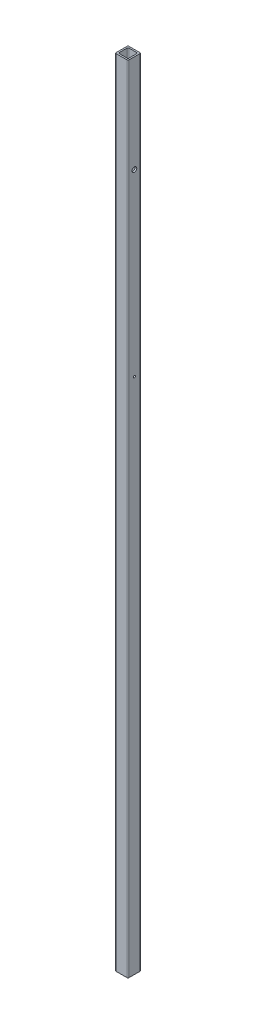
ISO-10303-21;
HEADER;
FILE_DESCRIPTION(('STEP AP214'),'2;1');
FILE_NAME('part.step','',(''),(''),'','','');
FILE_SCHEMA(('AUTOMOTIVE_DESIGN { 1 0 10303 214 1 1 1 1 }'));
ENDSEC;
DATA;
#1=APPLICATION_CONTEXT('core data for automotive mechanical design processes');
#2=APPLICATION_PROTOCOL_DEFINITION('international standard','automotive_design',2000,#1);
#3=PRODUCT_CONTEXT('',#1,'mechanical');
#4=PRODUCT('Part','Part','',(#3));
#5=PRODUCT_RELATED_PRODUCT_CATEGORY('part','',(#4));
#6=PRODUCT_DEFINITION_FORMATION('','',#4);
#7=PRODUCT_DEFINITION_CONTEXT('part definition',#1,'design');
#8=PRODUCT_DEFINITION('design','',#6,#7);
#9=PRODUCT_DEFINITION_SHAPE('','',#8);
#10=(LENGTH_UNIT() NAMED_UNIT(*) SI_UNIT(.MILLI.,.METRE.));
#11=(NAMED_UNIT(*) PLANE_ANGLE_UNIT() SI_UNIT($,.RADIAN.));
#12=(NAMED_UNIT(*) SI_UNIT($,.STERADIAN.) SOLID_ANGLE_UNIT());
#13=UNCERTAINTY_MEASURE_WITH_UNIT(LENGTH_MEASURE(1.E-05),#10,'distance_accuracy_value','');
#14=(GEOMETRIC_REPRESENTATION_CONTEXT(3) GLOBAL_UNCERTAINTY_ASSIGNED_CONTEXT((#13)) GLOBAL_UNIT_ASSIGNED_CONTEXT((#10,
#11,#12)) REPRESENTATION_CONTEXT('',''));
#15=CARTESIAN_POINT('',(0.,0.,0.));
#16=DIRECTION('',(0.,0.,1.));
#17=DIRECTION('',(1.,0.,0.));
#18=AXIS2_PLACEMENT_3D('',#15,#16,#17);
#19=CARTESIAN_POINT('',(12.7,1389.634,0.));
#20=DIRECTION('',(1.,0.,0.));
#21=DIRECTION('',(0.,0.,-1.));
#22=AXIS2_PLACEMENT_3D('',#19,#20,#21);
#23=CYLINDRICAL_SURFACE('',#22,4.7625);
#24=CARTESIAN_POINT('',(9.652,1389.634,0.));
#25=DIRECTION('',(1.,0.,0.));
#26=DIRECTION('',(0.,0.,-1.));
#27=AXIS2_PLACEMENT_3D('',#24,#25,#26);
#28=CIRCLE('',#27,4.7625);
#29=CARTESIAN_POINT('',(9.652,1389.634,-4.7625));
#30=VERTEX_POINT('',#29);
#31=EDGE_CURVE('P0_E152',#30,#30,#28,.T.);
#32=ORIENTED_EDGE('',*,*,#31,.F.);
#33=EDGE_LOOP('',(#32));
#34=FACE_BOUND('',#33,.T.);
#35=CARTESIAN_POINT('',(12.7,1389.634,0.));
#36=DIRECTION('',(1.,0.,0.));
#37=DIRECTION('',(0.,0.,-1.));
#38=AXIS2_PLACEMENT_3D('',#35,#36,#37);
#39=CIRCLE('',#38,4.7625);
#40=CARTESIAN_POINT('',(12.7,1389.634,-4.7625));
#41=VERTEX_POINT('',#40);
#42=EDGE_CURVE('P0_E160',#41,#41,#39,.F.);
#43=ORIENTED_EDGE('',*,*,#42,.F.);
#44=EDGE_LOOP('',(#43));
#45=FACE_BOUND('',#44,.T.);
#46=ADVANCED_FACE('P0_F17',(#34,#45),#23,.F.);
#47=CARTESIAN_POINT('',(-17.9109837404018,1031.875,0.));
#48=DIRECTION('',(1.,0.,0.));
#49=DIRECTION('',(0.,0.,-1.));
#50=AXIS2_PLACEMENT_3D('',#47,#48,#49);
#51=CYLINDRICAL_SURFACE('',#50,2.0193);
#52=CARTESIAN_POINT('',(9.652,1031.875,0.));
#53=DIRECTION('',(1.,0.,0.));
#54=DIRECTION('',(0.,0.,-1.));
#55=AXIS2_PLACEMENT_3D('',#52,#53,#54);
#56=CIRCLE('',#55,2.0193);
#57=CARTESIAN_POINT('',(9.652,1031.875,-2.0193));
#58=VERTEX_POINT('',#57);
#59=EDGE_CURVE('P0_E148',#58,#58,#56,.T.);
#60=ORIENTED_EDGE('',*,*,#59,.F.);
#61=EDGE_LOOP('',(#60));
#62=FACE_BOUND('',#61,.T.);
#63=CARTESIAN_POINT('',(12.7,1031.875,0.));
#64=DIRECTION('',(1.,0.,0.));
#65=DIRECTION('',(0.,0.,-1.));
#66=AXIS2_PLACEMENT_3D('',#63,#64,#65);
#67=CIRCLE('',#66,2.0193);
#68=CARTESIAN_POINT('',(12.7,1031.875,-2.0193));
#69=VERTEX_POINT('',#68);
#70=EDGE_CURVE('P0_E156',#69,#69,#67,.F.);
#71=ORIENTED_EDGE('',*,*,#70,.F.);
#72=EDGE_LOOP('',(#71));
#73=FACE_BOUND('',#72,.T.);
#74=ADVANCED_FACE('P0_F176',(#62,#73),#51,.F.);
#75=CARTESIAN_POINT('',(12.7,1389.634,0.));
#76=DIRECTION('',(1.,0.,0.));
#77=DIRECTION('',(0.,0.,-1.));
#78=AXIS2_PLACEMENT_3D('',#75,#76,#77);
#79=CYLINDRICAL_SURFACE('',#78,4.7625);
#80=CARTESIAN_POINT('',(-9.652,1389.634,0.));
#81=DIRECTION('',(1.,0.,0.));
#82=DIRECTION('',(0.,0.,-1.));
#83=AXIS2_PLACEMENT_3D('',#80,#81,#82);
#84=CIRCLE('',#83,4.7625);
#85=CARTESIAN_POINT('',(-9.652,1389.634,-4.7625));
#86=VERTEX_POINT('',#85);
#87=EDGE_CURVE('P0_E144',#86,#86,#84,.F.);
#88=ORIENTED_EDGE('',*,*,#87,.F.);
#89=EDGE_LOOP('',(#88));
#90=FACE_BOUND('',#89,.T.);
#91=CARTESIAN_POINT('',(-12.7,1389.634,0.));
#92=DIRECTION('',(1.,0.,0.));
#93=DIRECTION('',(0.,0.,-1.));
#94=AXIS2_PLACEMENT_3D('',#91,#92,#93);
#95=CIRCLE('',#94,4.7625);
#96=CARTESIAN_POINT('',(-12.7,1389.634,-4.7625));
#97=VERTEX_POINT('',#96);
#98=EDGE_CURVE('P0_E20',#97,#97,#95,.T.);
#99=ORIENTED_EDGE('',*,*,#98,.F.);
#100=EDGE_LOOP('',(#99));
#101=FACE_BOUND('',#100,.T.);
#102=ADVANCED_FACE('P0_F173',(#90,#101),#79,.F.);
#103=CARTESIAN_POINT('',(-17.9109837404018,1031.875,0.));
#104=DIRECTION('',(1.,0.,0.));
#105=DIRECTION('',(0.,0.,-1.));
#106=AXIS2_PLACEMENT_3D('',#103,#104,#105);
#107=CYLINDRICAL_SURFACE('',#106,2.0193);
#108=CARTESIAN_POINT('',(-12.7,1031.875,0.));
#109=DIRECTION('',(1.,0.,0.));
#110=DIRECTION('',(0.,0.,-1.));
#111=AXIS2_PLACEMENT_3D('',#108,#109,#110);
#112=CIRCLE('',#111,2.0193);
#113=CARTESIAN_POINT('',(-12.7,1031.875,-2.0193));
#114=VERTEX_POINT('',#113);
#115=EDGE_CURVE('P0_E163',#114,#114,#112,.T.);
#116=ORIENTED_EDGE('',*,*,#115,.F.);
#117=EDGE_LOOP('',(#116));
#118=FACE_BOUND('',#117,.T.);
#119=CARTESIAN_POINT('',(-9.652,1031.875,0.));
#120=DIRECTION('',(1.,0.,0.));
#121=DIRECTION('',(0.,0.,-1.));
#122=AXIS2_PLACEMENT_3D('',#119,#120,#121);
#123=CIRCLE('',#122,2.0193);
#124=CARTESIAN_POINT('',(-9.652,1031.875,-2.0193));
#125=VERTEX_POINT('',#124);
#126=EDGE_CURVE('P0_E140',#125,#125,#123,.F.);
#127=ORIENTED_EDGE('',*,*,#126,.F.);
#128=EDGE_LOOP('',(#127));
#129=FACE_BOUND('',#128,.T.);
#130=ADVANCED_FACE('P0_F175',(#118,#129),#107,.F.);
#131=CARTESIAN_POINT('',(-12.7,0.,-11.176));
#132=DIRECTION('',(-1.,0.,0.));
#133=DIRECTION('',(0.,0.,1.));
#134=AXIS2_PLACEMENT_3D('',#131,#132,#133);
#135=PLANE('',#134);
#136=ORIENTED_EDGE('',*,*,#115,.T.);
#137=EDGE_LOOP('',(#136));
#138=FACE_BOUND('',#137,.T.);
#139=ORIENTED_EDGE('',*,*,#98,.T.);
#140=EDGE_LOOP('',(#139));
#141=FACE_BOUND('',#140,.T.);
#142=DIRECTION('',(0.,1.,0.));
#143=VECTOR('',#142,1.);
#144=CARTESIAN_POINT('',(-12.7,0.,-11.176));
#145=LINE('',#144,#143);
#146=CARTESIAN_POINT('',(-12.7,0.,-11.176));
#147=VERTEX_POINT('',#146);
#148=CARTESIAN_POINT('',(-12.7,1584.325,-11.176));
#149=VERTEX_POINT('',#148);
#150=EDGE_CURVE('P0_E135',#147,#149,#145,.T.);
#151=ORIENTED_EDGE('',*,*,#150,.F.);
#152=DIRECTION('',(0.,0.,1.));
#153=VECTOR('',#152,1.);
#154=CARTESIAN_POINT('',(-12.7,0.,0.));
#155=LINE('',#154,#153);
#156=CARTESIAN_POINT('',(-12.7,0.,11.176));
#157=VERTEX_POINT('',#156);
#158=EDGE_CURVE('P0_E417',#147,#157,#155,.T.);
#159=ORIENTED_EDGE('',*,*,#158,.T.);
#160=DIRECTION('',(0.,1.,0.));
#161=VECTOR('',#160,1.);
#162=CARTESIAN_POINT('',(-12.7,0.,11.176));
#163=LINE('',#162,#161);
#164=CARTESIAN_POINT('',(-12.7,1584.325,11.176));
#165=VERTEX_POINT('',#164);
#166=EDGE_CURVE('P0_E104',#165,#157,#163,.F.);
#167=ORIENTED_EDGE('',*,*,#166,.F.);
#168=DIRECTION('',(0.,0.,1.));
#169=VECTOR('',#168,1.);
#170=CARTESIAN_POINT('',(-12.7,1584.325,0.));
#171=LINE('',#170,#169);
#172=EDGE_CURVE('P0_E133',#149,#165,#171,.T.);
#173=ORIENTED_EDGE('',*,*,#172,.F.);
#174=EDGE_LOOP('',(#151,#159,#167,#173));
#175=FACE_BOUND('',#174,.T.);
#176=ADVANCED_FACE('P0_F171',(#138,#141,#175),#135,.T.);
#177=CARTESIAN_POINT('',(-11.176,0.,11.176));
#178=DIRECTION('',(0.,1.,0.));
#179=DIRECTION('',(0.,0.,1.));
#180=AXIS2_PLACEMENT_3D('',#177,#178,#179);
#181=CYLINDRICAL_SURFACE('',#180,1.524);
#182=ORIENTED_EDGE('',*,*,#166,.T.);
#183=CARTESIAN_POINT('',(-11.176,0.,11.176));
#184=DIRECTION('',(0.,1.,0.));
#185=DIRECTION('',(0.,0.,1.));
#186=AXIS2_PLACEMENT_3D('',#183,#184,#185);
#187=CIRCLE('',#186,1.524);
#188=CARTESIAN_POINT('',(-11.176,0.,12.7));
#189=VERTEX_POINT('',#188);
#190=EDGE_CURVE('P0_E116',#157,#189,#187,.T.);
#191=ORIENTED_EDGE('',*,*,#190,.T.);
#192=DIRECTION('',(0.,1.,0.));
#193=VECTOR('',#192,1.);
#194=CARTESIAN_POINT('',(-11.176,0.,12.7));
#195=LINE('',#194,#193);
#196=CARTESIAN_POINT('',(-11.176,1584.325,12.7));
#197=VERTEX_POINT('',#196);
#198=EDGE_CURVE('P0_E109',#197,#189,#195,.F.);
#199=ORIENTED_EDGE('',*,*,#198,.F.);
#200=CARTESIAN_POINT('',(-11.176,1584.325,11.176));
#201=DIRECTION('',(0.,1.,0.));
#202=DIRECTION('',(0.,0.,1.));
#203=AXIS2_PLACEMENT_3D('',#200,#201,#202);
#204=CIRCLE('',#203,1.524);
#205=EDGE_CURVE('P0_E113',#165,#197,#204,.T.);
#206=ORIENTED_EDGE('',*,*,#205,.F.);
#207=EDGE_LOOP('',(#182,#191,#199,#206));
#208=FACE_BOUND('',#207,.T.);
#209=ADVANCED_FACE('P0_F111',(#208),#181,.T.);
#210=CARTESIAN_POINT('',(-11.176,0.,12.7));
#211=DIRECTION('',(0.,0.,1.));
#212=DIRECTION('',(1.,0.,0.));
#213=AXIS2_PLACEMENT_3D('',#210,#211,#212);
#214=PLANE('',#213);
#215=ORIENTED_EDGE('',*,*,#198,.T.);
#216=DIRECTION('',(1.,0.,0.));
#217=VECTOR('',#216,1.);
#218=CARTESIAN_POINT('',(0.,0.,12.7));
#219=LINE('',#218,#217);
#220=CARTESIAN_POINT('',(11.176,0.,12.7));
#221=VERTEX_POINT('',#220);
#222=EDGE_CURVE('P0_E411',#189,#221,#219,.T.);
#223=ORIENTED_EDGE('',*,*,#222,.T.);
#224=DIRECTION('',(0.,1.,0.));
#225=VECTOR('',#224,1.);
#226=CARTESIAN_POINT('',(11.176,0.,12.7));
#227=LINE('',#226,#225);
#228=CARTESIAN_POINT('',(11.176,1584.325,12.7));
#229=VERTEX_POINT('',#228);
#230=EDGE_CURVE('P0_E119',#229,#221,#227,.F.);
#231=ORIENTED_EDGE('',*,*,#230,.F.);
#232=DIRECTION('',(1.,0.,0.));
#233=VECTOR('',#232,1.);
#234=CARTESIAN_POINT('',(0.,1584.325,12.7));
#235=LINE('',#234,#233);
#236=EDGE_CURVE('P0_E122',#197,#229,#235,.T.);
#237=ORIENTED_EDGE('',*,*,#236,.F.);
#238=EDGE_LOOP('',(#215,#223,#231,#237));
#239=FACE_BOUND('',#238,.T.);
#240=ADVANCED_FACE('P0_F123',(#239),#214,.T.);
#241=CARTESIAN_POINT('',(11.176,0.,11.176));
#242=DIRECTION('',(0.,1.,0.));
#243=DIRECTION('',(0.,0.,1.));
#244=AXIS2_PLACEMENT_3D('',#241,#242,#243);
#245=CYLINDRICAL_SURFACE('',#244,1.524);
#246=ORIENTED_EDGE('',*,*,#230,.T.);
#247=CARTESIAN_POINT('',(11.176,0.,11.176));
#248=DIRECTION('',(0.,1.,0.));
#249=DIRECTION('',(0.,0.,1.));
#250=AXIS2_PLACEMENT_3D('',#247,#248,#249);
#251=CIRCLE('',#250,1.524);
#252=CARTESIAN_POINT('',(12.7,0.,11.176));
#253=VERTEX_POINT('',#252);
#254=EDGE_CURVE('P0_E407',#221,#253,#251,.T.);
#255=ORIENTED_EDGE('',*,*,#254,.T.);
#256=DIRECTION('',(0.,1.,0.));
#257=VECTOR('',#256,1.);
#258=CARTESIAN_POINT('',(12.7,0.,11.176));
#259=LINE('',#258,#257);
#260=CARTESIAN_POINT('',(12.7,1584.325,11.176));
#261=VERTEX_POINT('',#260);
#262=EDGE_CURVE('P0_E162',#261,#253,#259,.F.);
#263=ORIENTED_EDGE('',*,*,#262,.F.);
#264=CARTESIAN_POINT('',(11.176,1584.325,11.176));
#265=DIRECTION('',(0.,1.,0.));
#266=DIRECTION('',(0.,0.,1.));
#267=AXIS2_PLACEMENT_3D('',#264,#265,#266);
#268=CIRCLE('',#267,1.524);
#269=EDGE_CURVE('P0_E128',#229,#261,#268,.T.);
#270=ORIENTED_EDGE('',*,*,#269,.F.);
#271=EDGE_LOOP('',(#246,#255,#263,#270));
#272=FACE_BOUND('',#271,.T.);
#273=ADVANCED_FACE('P0_F245',(#272),#245,.T.);
#274=CARTESIAN_POINT('',(12.7,0.,11.176));
#275=DIRECTION('',(1.,0.,0.));
#276=DIRECTION('',(0.,0.,-1.));
#277=AXIS2_PLACEMENT_3D('',#274,#275,#276);
#278=PLANE('',#277);
#279=ORIENTED_EDGE('',*,*,#70,.T.);
#280=EDGE_LOOP('',(#279));
#281=FACE_BOUND('',#280,.T.);
#282=ORIENTED_EDGE('',*,*,#42,.T.);
#283=EDGE_LOOP('',(#282));
#284=FACE_BOUND('',#283,.T.);
#285=ORIENTED_EDGE('',*,*,#262,.T.);
#286=DIRECTION('',(0.,0.,1.));
#287=VECTOR('',#286,1.);
#288=CARTESIAN_POINT('',(12.7,0.,0.));
#289=LINE('',#288,#287);
#290=CARTESIAN_POINT('',(12.7,0.,-11.176));
#291=VERTEX_POINT('',#290);
#292=EDGE_CURVE('P0_E402',#253,#291,#289,.F.);
#293=ORIENTED_EDGE('',*,*,#292,.T.);
#294=DIRECTION('',(0.,1.,0.));
#295=VECTOR('',#294,1.);
#296=CARTESIAN_POINT('',(12.7,0.,-11.176));
#297=LINE('',#296,#295);
#298=CARTESIAN_POINT('',(12.7,1584.325,-11.176));
#299=VERTEX_POINT('',#298);
#300=EDGE_CURVE('P0_E462',#299,#291,#297,.F.);
#301=ORIENTED_EDGE('',*,*,#300,.F.);
#302=DIRECTION('',(0.,0.,1.));
#303=VECTOR('',#302,1.);
#304=CARTESIAN_POINT('',(12.7,1584.325,0.));
#305=LINE('',#304,#303);
#306=EDGE_CURVE('P0_E403',#261,#299,#305,.F.);
#307=ORIENTED_EDGE('',*,*,#306,.F.);
#308=EDGE_LOOP('',(#285,#293,#301,#307));
#309=FACE_BOUND('',#308,.T.);
#310=ADVANCED_FACE('P0_F241',(#281,#284,#309),#278,.T.);
#311=CARTESIAN_POINT('',(-8.0772,0.,-9.652));
#312=DIRECTION('',(0.,0.,1.));
#313=DIRECTION('',(1.,0.,0.));
#314=AXIS2_PLACEMENT_3D('',#311,#312,#313);
#315=PLANE('',#314);
#316=DIRECTION('',(0.,1.,0.));
#317=VECTOR('',#316,1.);
#318=CARTESIAN_POINT('',(-8.0772,0.,-9.652));
#319=LINE('',#318,#317);
#320=CARTESIAN_POINT('',(-8.0772,1584.325,-9.652));
#321=VERTEX_POINT('',#320);
#322=CARTESIAN_POINT('',(-8.0772,0.,-9.652));
#323=VERTEX_POINT('',#322);
#324=EDGE_CURVE('P0_E447',#321,#323,#319,.F.);
#325=ORIENTED_EDGE('',*,*,#324,.T.);
#326=DIRECTION('',(1.,0.,0.));
#327=VECTOR('',#326,1.);
#328=CARTESIAN_POINT('',(0.,0.,-9.652));
#329=LINE('',#328,#327);
#330=CARTESIAN_POINT('',(8.128,0.,-9.652));
#331=VERTEX_POINT('',#330);
#332=EDGE_CURVE('P0_E409',#323,#331,#329,.T.);
#333=ORIENTED_EDGE('',*,*,#332,.T.);
#334=DIRECTION('',(0.,1.,0.));
#335=VECTOR('',#334,1.);
#336=CARTESIAN_POINT('',(8.128,0.,-9.652));
#337=LINE('',#336,#335);
#338=CARTESIAN_POINT('',(8.128,1584.325,-9.652));
#339=VERTEX_POINT('',#338);
#340=EDGE_CURVE('P0_E159',#331,#339,#337,.T.);
#341=ORIENTED_EDGE('',*,*,#340,.T.);
#342=DIRECTION('',(1.,0.,0.));
#343=VECTOR('',#342,1.);
#344=CARTESIAN_POINT('',(0.,1584.325,-9.652));
#345=LINE('',#344,#343);
#346=EDGE_CURVE('P0_E428',#321,#339,#345,.T.);
#347=ORIENTED_EDGE('',*,*,#346,.F.);
#348=EDGE_LOOP('',(#325,#333,#341,#347));
#349=FACE_BOUND('',#348,.T.);
#350=ADVANCED_FACE('P0_F237',(#349),#315,.T.);
#351=CARTESIAN_POINT('',(8.128,0.,-8.128));
#352=DIRECTION('',(0.,1.,0.));
#353=DIRECTION('',(0.,0.,1.));
#354=AXIS2_PLACEMENT_3D('',#351,#352,#353);
#355=CYLINDRICAL_SURFACE('',#354,1.524);
#356=CARTESIAN_POINT('',(8.128,1584.325,-8.128));
#357=DIRECTION('',(0.,1.,0.));
#358=DIRECTION('',(0.,0.,1.));
#359=AXIS2_PLACEMENT_3D('',#356,#357,#358);
#360=CIRCLE('',#359,1.524);
#361=CARTESIAN_POINT('',(9.652,1584.325,-8.128));
#362=VERTEX_POINT('',#361);
#363=EDGE_CURVE('P0_E444',#339,#362,#360,.F.);
#364=ORIENTED_EDGE('',*,*,#363,.F.);
#365=ORIENTED_EDGE('',*,*,#340,.F.);
#366=CARTESIAN_POINT('',(8.128,0.,-8.128));
#367=DIRECTION('',(0.,1.,0.));
#368=DIRECTION('',(0.,0.,1.));
#369=AXIS2_PLACEMENT_3D('',#366,#367,#368);
#370=CIRCLE('',#369,1.524);
#371=CARTESIAN_POINT('',(9.652,0.,-8.128));
#372=VERTEX_POINT('',#371);
#373=EDGE_CURVE('P0_E478',#331,#372,#370,.F.);
#374=ORIENTED_EDGE('',*,*,#373,.T.);
#375=DIRECTION('',(0.,1.,0.));
#376=VECTOR('',#375,1.);
#377=CARTESIAN_POINT('',(9.652,0.,-8.128));
#378=LINE('',#377,#376);
#379=EDGE_CURVE('P0_E155',#362,#372,#378,.F.);
#380=ORIENTED_EDGE('',*,*,#379,.F.);
#381=EDGE_LOOP('',(#364,#365,#374,#380));
#382=FACE_BOUND('',#381,.T.);
#383=ADVANCED_FACE('P0_F233',(#382),#355,.F.);
#384=CARTESIAN_POINT('',(9.652,0.,-8.128));
#385=DIRECTION('',(-1.,0.,0.));
#386=DIRECTION('',(0.,0.,1.));
#387=AXIS2_PLACEMENT_3D('',#384,#385,#386);
#388=PLANE('',#387);
#389=ORIENTED_EDGE('',*,*,#59,.T.);
#390=EDGE_LOOP('',(#389));
#391=FACE_BOUND('',#390,.T.);
#392=ORIENTED_EDGE('',*,*,#31,.T.);
#393=EDGE_LOOP('',(#392));
#394=FACE_BOUND('',#393,.T.);
#395=ORIENTED_EDGE('',*,*,#379,.T.);
#396=DIRECTION('',(0.,0.,1.));
#397=VECTOR('',#396,1.);
#398=CARTESIAN_POINT('',(9.652,0.,0.));
#399=LINE('',#398,#397);
#400=CARTESIAN_POINT('',(9.652,0.,8.0772));
#401=VERTEX_POINT('',#400);
#402=EDGE_CURVE('P0_E477',#372,#401,#399,.T.);
#403=ORIENTED_EDGE('',*,*,#402,.T.);
#404=DIRECTION('',(0.,1.,0.));
#405=VECTOR('',#404,1.);
#406=CARTESIAN_POINT('',(9.652,0.,8.0772));
#407=LINE('',#406,#405);
#408=CARTESIAN_POINT('',(9.652,1584.325,8.0772));
#409=VERTEX_POINT('',#408);
#410=EDGE_CURVE('P0_E151',#401,#409,#407,.T.);
#411=ORIENTED_EDGE('',*,*,#410,.T.);
#412=DIRECTION('',(0.,0.,1.));
#413=VECTOR('',#412,1.);
#414=CARTESIAN_POINT('',(9.652,1584.325,0.));
#415=LINE('',#414,#413);
#416=EDGE_CURVE('P0_E441',#362,#409,#415,.T.);
#417=ORIENTED_EDGE('',*,*,#416,.F.);
#418=EDGE_LOOP('',(#395,#403,#411,#417));
#419=FACE_BOUND('',#418,.T.);
#420=ADVANCED_FACE('P0_F229',(#391,#394,#419),#388,.T.);
#421=CARTESIAN_POINT('',(8.0772,0.,8.0772));
#422=DIRECTION('',(0.,1.,0.));
#423=DIRECTION('',(0.,0.,1.));
#424=AXIS2_PLACEMENT_3D('',#421,#422,#423);
#425=CYLINDRICAL_SURFACE('',#424,1.5748);
#426=CARTESIAN_POINT('',(8.0772,1584.325,8.0772));
#427=DIRECTION('',(0.,1.,0.));
#428=DIRECTION('',(0.,0.,1.));
#429=AXIS2_PLACEMENT_3D('',#426,#427,#428);
#430=CIRCLE('',#429,1.5748);
#431=CARTESIAN_POINT('',(8.0772,1584.325,9.652));
#432=VERTEX_POINT('',#431);
#433=EDGE_CURVE('P0_E440',#409,#432,#430,.F.);
#434=ORIENTED_EDGE('',*,*,#433,.F.);
#435=ORIENTED_EDGE('',*,*,#410,.F.);
#436=CARTESIAN_POINT('',(8.0772,0.,8.0772));
#437=DIRECTION('',(0.,1.,0.));
#438=DIRECTION('',(0.,0.,1.));
#439=AXIS2_PLACEMENT_3D('',#436,#437,#438);
#440=CIRCLE('',#439,1.5748);
#441=CARTESIAN_POINT('',(8.0772,0.,9.652));
#442=VERTEX_POINT('',#441);
#443=EDGE_CURVE('P0_E474',#401,#442,#440,.F.);
#444=ORIENTED_EDGE('',*,*,#443,.T.);
#445=DIRECTION('',(0.,1.,0.));
#446=VECTOR('',#445,1.);
#447=CARTESIAN_POINT('',(8.0772,0.,9.652));
#448=LINE('',#447,#446);
#449=EDGE_CURVE('P0_E455',#432,#442,#448,.F.);
#450=ORIENTED_EDGE('',*,*,#449,.F.);
#451=EDGE_LOOP('',(#434,#435,#444,#450));
#452=FACE_BOUND('',#451,.T.);
#453=ADVANCED_FACE('P0_F225',(#452),#425,.F.);
#454=CARTESIAN_POINT('',(8.0772,0.,9.652));
#455=DIRECTION('',(0.,0.,-1.));
#456=DIRECTION('',(-1.,0.,0.));
#457=AXIS2_PLACEMENT_3D('',#454,#455,#456);
#458=PLANE('',#457);
#459=ORIENTED_EDGE('',*,*,#449,.T.);
#460=DIRECTION('',(1.,0.,0.));
#461=VECTOR('',#460,1.);
#462=CARTESIAN_POINT('',(0.,0.,9.652));
#463=LINE('',#462,#461);
#464=CARTESIAN_POINT('',(-8.128,0.,9.652));
#465=VERTEX_POINT('',#464);
#466=EDGE_CURVE('P0_E473',#442,#465,#463,.F.);
#467=ORIENTED_EDGE('',*,*,#466,.T.);
#468=DIRECTION('',(0.,1.,0.));
#469=VECTOR('',#468,1.);
#470=CARTESIAN_POINT('',(-8.128,0.,9.652));
#471=LINE('',#470,#469);
#472=CARTESIAN_POINT('',(-8.128,1584.325,9.652));
#473=VERTEX_POINT('',#472);
#474=EDGE_CURVE('P0_E453',#465,#473,#471,.T.);
#475=ORIENTED_EDGE('',*,*,#474,.T.);
#476=DIRECTION('',(1.,0.,0.));
#477=VECTOR('',#476,1.);
#478=CARTESIAN_POINT('',(0.,1584.325,9.652));
#479=LINE('',#478,#477);
#480=EDGE_CURVE('P0_E437',#432,#473,#479,.F.);
#481=ORIENTED_EDGE('',*,*,#480,.F.);
#482=EDGE_LOOP('',(#459,#467,#475,#481));
#483=FACE_BOUND('',#482,.T.);
#484=ADVANCED_FACE('P0_F221',(#483),#458,.T.);
#485=CARTESIAN_POINT('',(-8.128,0.,8.128));
#486=DIRECTION('',(0.,1.,0.));
#487=DIRECTION('',(0.,0.,1.));
#488=AXIS2_PLACEMENT_3D('',#485,#486,#487);
#489=CYLINDRICAL_SURFACE('',#488,1.524);
#490=CARTESIAN_POINT('',(-8.128,1584.325,8.128));
#491=DIRECTION('',(0.,1.,0.));
#492=DIRECTION('',(0.,0.,1.));
#493=AXIS2_PLACEMENT_3D('',#490,#491,#492);
#494=CIRCLE('',#493,1.524);
#495=CARTESIAN_POINT('',(-9.652,1584.325,8.128));
#496=VERTEX_POINT('',#495);
#497=EDGE_CURVE('P0_E436',#473,#496,#494,.F.);
#498=ORIENTED_EDGE('',*,*,#497,.F.);
#499=ORIENTED_EDGE('',*,*,#474,.F.);
#500=CARTESIAN_POINT('',(-8.128,0.,8.128));
#501=DIRECTION('',(0.,1.,0.));
#502=DIRECTION('',(0.,0.,1.));
#503=AXIS2_PLACEMENT_3D('',#500,#501,#502);
#504=CIRCLE('',#503,1.524);
#505=CARTESIAN_POINT('',(-9.652,0.,8.128));
#506=VERTEX_POINT('',#505);
#507=EDGE_CURVE('P0_E470',#465,#506,#504,.F.);
#508=ORIENTED_EDGE('',*,*,#507,.T.);
#509=DIRECTION('',(0.,1.,0.));
#510=VECTOR('',#509,1.);
#511=CARTESIAN_POINT('',(-9.652,0.,8.128));
#512=LINE('',#511,#510);
#513=EDGE_CURVE('P0_E147',#496,#506,#512,.F.);
#514=ORIENTED_EDGE('',*,*,#513,.F.);
#515=EDGE_LOOP('',(#498,#499,#508,#514));
#516=FACE_BOUND('',#515,.T.);
#517=ADVANCED_FACE('P0_F217',(#516),#489,.F.);
#518=CARTESIAN_POINT('',(-9.652,0.,8.128));
#519=DIRECTION('',(1.,0.,0.));
#520=DIRECTION('',(0.,0.,-1.));
#521=AXIS2_PLACEMENT_3D('',#518,#519,#520);
#522=PLANE('',#521);
#523=ORIENTED_EDGE('',*,*,#126,.T.);
#524=EDGE_LOOP('',(#523));
#525=FACE_BOUND('',#524,.T.);
#526=ORIENTED_EDGE('',*,*,#87,.T.);
#527=EDGE_LOOP('',(#526));
#528=FACE_BOUND('',#527,.T.);
#529=ORIENTED_EDGE('',*,*,#513,.T.);
#530=DIRECTION('',(0.,0.,1.));
#531=VECTOR('',#530,1.);
#532=CARTESIAN_POINT('',(-9.652,0.,0.));
#533=LINE('',#532,#531);
#534=CARTESIAN_POINT('',(-9.652,0.,-8.0772));
#535=VERTEX_POINT('',#534);
#536=EDGE_CURVE('P0_E469',#506,#535,#533,.F.);
#537=ORIENTED_EDGE('',*,*,#536,.T.);
#538=DIRECTION('',(0.,1.,0.));
#539=VECTOR('',#538,1.);
#540=CARTESIAN_POINT('',(-9.652,0.,-8.0772));
#541=LINE('',#540,#539);
#542=CARTESIAN_POINT('',(-9.652,1584.325,-8.0772));
#543=VERTEX_POINT('',#542);
#544=EDGE_CURVE('P0_E143',#535,#543,#541,.T.);
#545=ORIENTED_EDGE('',*,*,#544,.T.);
#546=DIRECTION('',(0.,0.,1.));
#547=VECTOR('',#546,1.);
#548=CARTESIAN_POINT('',(-9.652,1584.325,0.));
#549=LINE('',#548,#547);
#550=EDGE_CURVE('P0_E433',#496,#543,#549,.F.);
#551=ORIENTED_EDGE('',*,*,#550,.F.);
#552=EDGE_LOOP('',(#529,#537,#545,#551));
#553=FACE_BOUND('',#552,.T.);
#554=ADVANCED_FACE('P0_F213',(#525,#528,#553),#522,.T.);
#555=CARTESIAN_POINT('',(-8.0772,0.,-8.0772));
#556=DIRECTION('',(0.,1.,0.));
#557=DIRECTION('',(0.,0.,1.));
#558=AXIS2_PLACEMENT_3D('',#555,#556,#557);
#559=CYLINDRICAL_SURFACE('',#558,1.5748);
#560=CARTESIAN_POINT('',(-8.0772,1584.325,-8.0772));
#561=DIRECTION('',(0.,1.,0.));
#562=DIRECTION('',(0.,0.,1.));
#563=AXIS2_PLACEMENT_3D('',#560,#561,#562);
#564=CIRCLE('',#563,1.5748);
#565=EDGE_CURVE('P0_E432',#543,#321,#564,.F.);
#566=ORIENTED_EDGE('',*,*,#565,.F.);
#567=ORIENTED_EDGE('',*,*,#544,.F.);
#568=CARTESIAN_POINT('',(-8.0772,0.,-8.0772));
#569=DIRECTION('',(0.,1.,0.));
#570=DIRECTION('',(0.,0.,1.));
#571=AXIS2_PLACEMENT_3D('',#568,#569,#570);
#572=CIRCLE('',#571,1.5748);
#573=EDGE_CURVE('P0_E425',#535,#323,#572,.F.);
#574=ORIENTED_EDGE('',*,*,#573,.T.);
#575=ORIENTED_EDGE('',*,*,#324,.F.);
#576=EDGE_LOOP('',(#566,#567,#574,#575));
#577=FACE_BOUND('',#576,.T.);
#578=ADVANCED_FACE('P0_F209',(#577),#559,.F.);
#579=CARTESIAN_POINT('',(-11.176,0.,-11.176));
#580=DIRECTION('',(0.,1.,0.));
#581=DIRECTION('',(0.,0.,1.));
#582=AXIS2_PLACEMENT_3D('',#579,#580,#581);
#583=CYLINDRICAL_SURFACE('',#582,1.524);
#584=DIRECTION('',(0.,1.,0.));
#585=VECTOR('',#584,1.);
#586=CARTESIAN_POINT('',(-11.176,0.,-12.7));
#587=LINE('',#586,#585);
#588=CARTESIAN_POINT('',(-11.176,0.,-12.7));
#589=VERTEX_POINT('',#588);
#590=CARTESIAN_POINT('',(-11.176,1584.325,-12.7));
#591=VERTEX_POINT('',#590);
#592=EDGE_CURVE('P0_E422',#589,#591,#587,.T.);
#593=ORIENTED_EDGE('',*,*,#592,.F.);
#594=CARTESIAN_POINT('',(-11.176,0.,-11.176));
#595=DIRECTION('',(0.,1.,0.));
#596=DIRECTION('',(0.,0.,1.));
#597=AXIS2_PLACEMENT_3D('',#594,#595,#596);
#598=CIRCLE('',#597,1.524);
#599=EDGE_CURVE('P0_E419',#589,#147,#598,.T.);
#600=ORIENTED_EDGE('',*,*,#599,.T.);
#601=ORIENTED_EDGE('',*,*,#150,.T.);
#602=CARTESIAN_POINT('',(-11.176,1584.325,-11.176));
#603=DIRECTION('',(0.,1.,0.));
#604=DIRECTION('',(0.,0.,1.));
#605=AXIS2_PLACEMENT_3D('',#602,#603,#604);
#606=CIRCLE('',#605,1.524);
#607=EDGE_CURVE('P0_E445',#591,#149,#606,.T.);
#608=ORIENTED_EDGE('',*,*,#607,.F.);
#609=EDGE_LOOP('',(#593,#600,#601,#608));
#610=FACE_BOUND('',#609,.T.);
#611=ADVANCED_FACE('P0_F205',(#610),#583,.T.);
#612=CARTESIAN_POINT('',(0.,1584.325,0.));
#613=DIRECTION('',(0.,1.,0.));
#614=DIRECTION('',(0.,0.,1.));
#615=AXIS2_PLACEMENT_3D('',#612,#613,#614);
#616=PLANE('',#615);
#617=ORIENTED_EDGE('',*,*,#565,.T.);
#618=ORIENTED_EDGE('',*,*,#346,.T.);
#619=ORIENTED_EDGE('',*,*,#363,.T.);
#620=ORIENTED_EDGE('',*,*,#416,.T.);
#621=ORIENTED_EDGE('',*,*,#433,.T.);
#622=ORIENTED_EDGE('',*,*,#480,.T.);
#623=ORIENTED_EDGE('',*,*,#497,.T.);
#624=ORIENTED_EDGE('',*,*,#550,.T.);
#625=EDGE_LOOP('',(#617,#618,#619,#620,#621,#622,#623,#624));
#626=FACE_BOUND('',#625,.T.);
#627=DIRECTION('',(-1.,0.,0.));
#628=VECTOR('',#627,1.);
#629=CARTESIAN_POINT('',(11.176,1584.325,-12.7));
#630=LINE('',#629,#628);
#631=CARTESIAN_POINT('',(11.176,1584.325,-12.7));
#632=VERTEX_POINT('',#631);
#633=EDGE_CURVE('P0_E420',#591,#632,#630,.F.);
#634=ORIENTED_EDGE('',*,*,#633,.F.);
#635=ORIENTED_EDGE('',*,*,#607,.T.);
#636=ORIENTED_EDGE('',*,*,#172,.T.);
#637=ORIENTED_EDGE('',*,*,#205,.T.);
#638=ORIENTED_EDGE('',*,*,#236,.T.);
#639=ORIENTED_EDGE('',*,*,#269,.T.);
#640=ORIENTED_EDGE('',*,*,#306,.T.);
#641=CARTESIAN_POINT('',(11.176,1584.325,-11.176));
#642=DIRECTION('',(0.,1.,0.));
#643=DIRECTION('',(0.,0.,1.));
#644=AXIS2_PLACEMENT_3D('',#641,#642,#643);
#645=CIRCLE('',#644,1.524);
#646=EDGE_CURVE('P0_E431',#632,#299,#645,.F.);
#647=ORIENTED_EDGE('',*,*,#646,.F.);
#648=EDGE_LOOP('',(#634,#635,#636,#637,#638,#639,#640,#647));
#649=FACE_BOUND('',#648,.T.);
#650=ADVANCED_FACE('P0_F131',(#626,#649),#616,.T.);
#651=CARTESIAN_POINT('',(11.176,0.,-11.176));
#652=DIRECTION('',(0.,1.,0.));
#653=DIRECTION('',(0.,0.,1.));
#654=AXIS2_PLACEMENT_3D('',#651,#652,#653);
#655=CYLINDRICAL_SURFACE('',#654,1.524);
#656=ORIENTED_EDGE('',*,*,#300,.T.);
#657=CARTESIAN_POINT('',(11.176,0.,-11.176));
#658=DIRECTION('',(0.,1.,0.));
#659=DIRECTION('',(0.,0.,1.));
#660=AXIS2_PLACEMENT_3D('',#657,#658,#659);
#661=CIRCLE('',#660,1.524);
#662=CARTESIAN_POINT('',(11.176,0.,-12.7));
#663=VERTEX_POINT('',#662);
#664=EDGE_CURVE('P0_E35',#291,#663,#661,.T.);
#665=ORIENTED_EDGE('',*,*,#664,.T.);
#666=DIRECTION('',(0.,1.,0.));
#667=VECTOR('',#666,1.);
#668=CARTESIAN_POINT('',(11.176,0.,-12.7));
#669=LINE('',#668,#667);
#670=EDGE_CURVE('P0_E26',#632,#663,#669,.F.);
#671=ORIENTED_EDGE('',*,*,#670,.F.);
#672=ORIENTED_EDGE('',*,*,#646,.T.);
#673=EDGE_LOOP('',(#656,#665,#671,#672));
#674=FACE_BOUND('',#673,.T.);
#675=ADVANCED_FACE('P0_F196',(#674),#655,.T.);
#676=CARTESIAN_POINT('',(0.,0.,0.));
#677=DIRECTION('',(0.,1.,0.));
#678=DIRECTION('',(0.,0.,1.));
#679=AXIS2_PLACEMENT_3D('',#676,#677,#678);
#680=PLANE('',#679);
#681=ORIENTED_EDGE('',*,*,#536,.F.);
#682=ORIENTED_EDGE('',*,*,#507,.F.);
#683=ORIENTED_EDGE('',*,*,#466,.F.);
#684=ORIENTED_EDGE('',*,*,#443,.F.);
#685=ORIENTED_EDGE('',*,*,#402,.F.);
#686=ORIENTED_EDGE('',*,*,#373,.F.);
#687=ORIENTED_EDGE('',*,*,#332,.F.);
#688=ORIENTED_EDGE('',*,*,#573,.F.);
#689=EDGE_LOOP('',(#681,#682,#683,#684,#685,#686,#687,#688));
#690=FACE_BOUND('',#689,.T.);
#691=ORIENTED_EDGE('',*,*,#664,.F.);
#692=ORIENTED_EDGE('',*,*,#292,.F.);
#693=ORIENTED_EDGE('',*,*,#254,.F.);
#694=ORIENTED_EDGE('',*,*,#222,.F.);
#695=ORIENTED_EDGE('',*,*,#190,.F.);
#696=ORIENTED_EDGE('',*,*,#158,.F.);
#697=ORIENTED_EDGE('',*,*,#599,.F.);
#698=DIRECTION('',(-1.,0.,0.));
#699=VECTOR('',#698,1.);
#700=CARTESIAN_POINT('',(11.176,0.,-12.7));
#701=LINE('',#700,#699);
#702=EDGE_CURVE('P0_E11',#663,#589,#701,.T.);
#703=ORIENTED_EDGE('',*,*,#702,.F.);
#704=EDGE_LOOP('',(#691,#692,#693,#694,#695,#696,#697,#703));
#705=FACE_BOUND('',#704,.T.);
#706=ADVANCED_FACE('P0_F190',(#690,#705),#680,.F.);
#707=CARTESIAN_POINT('',(11.176,0.,-12.7));
#708=DIRECTION('',(0.,0.,-1.));
#709=DIRECTION('',(-1.,0.,0.));
#710=AXIS2_PLACEMENT_3D('',#707,#708,#709);
#711=PLANE('',#710);
#712=ORIENTED_EDGE('',*,*,#670,.T.);
#713=ORIENTED_EDGE('',*,*,#702,.T.);
#714=ORIENTED_EDGE('',*,*,#592,.T.);
#715=ORIENTED_EDGE('',*,*,#633,.T.);
#716=EDGE_LOOP('',(#712,#713,#714,#715));
#717=FACE_BOUND('',#716,.T.);
#718=ADVANCED_FACE('P0_F188',(#717),#711,.T.);
#719=CLOSED_SHELL('',(#46,#74,#102,#130,#176,#209,#240,#273,#310,#350,#383,#420,#453,#484,#517,
#554,#578,#611,#650,#675,#706,#718));
#720=MANIFOLD_SOLID_BREP('P0_B1',#719);
#721=CARTESIAN_POINT('',(-17.9109837404018,1031.875,0.));
#722=DIRECTION('',(1.,0.,0.));
#723=DIRECTION('',(0.,0.,-1.));
#724=AXIS2_PLACEMENT_3D('',#721,#722,#723);
#725=CYLINDRICAL_SURFACE('',#724,2.413);
#726=CARTESIAN_POINT('',(9.652,1031.875,0.));
#727=DIRECTION('',(1.,0.,0.));
#728=DIRECTION('',(0.,0.,-1.));
#729=AXIS2_PLACEMENT_3D('',#726,#727,#728);
#730=CIRCLE('',#729,2.413);
#731=CARTESIAN_POINT('',(9.652,1031.875,-2.413));
#732=VERTEX_POINT('',#731);
#733=EDGE_CURVE('P1_E10',#732,#732,#730,.T.);
#734=ORIENTED_EDGE('',*,*,#733,.T.);
#735=EDGE_LOOP('',(#734));
#736=FACE_BOUND('',#735,.T.);
#737=CARTESIAN_POINT('',(12.7,1031.875,0.));
#738=DIRECTION('',(1.,0.,0.));
#739=DIRECTION('',(0.,0.,-1.));
#740=AXIS2_PLACEMENT_3D('',#737,#738,#739);
#741=CIRCLE('',#740,2.413);
#742=CARTESIAN_POINT('',(12.7,1031.875,-2.413));
#743=VERTEX_POINT('',#742);
#744=EDGE_CURVE('P1_E16',#743,#743,#741,.F.);
#745=ORIENTED_EDGE('',*,*,#744,.T.);
#746=EDGE_LOOP('',(#745));
#747=FACE_BOUND('',#746,.T.);
#748=ADVANCED_FACE('P1_F15',(#736,#747),#725,.T.);
#749=OPEN_SHELL('',(#748));
#750=SHELL_BASED_SURFACE_MODEL('P1_B1',(#749));
#751=ADVANCED_BREP_SHAPE_REPRESENTATION('',(#18,#720),#14);
#752=MANIFOLD_SURFACE_SHAPE_REPRESENTATION('',(#18,#750),#14);
#753=SHAPE_REPRESENTATION('',(#18),#14);
#754=SHAPE_DEFINITION_REPRESENTATION(#9,#753);
#755=SHAPE_REPRESENTATION_RELATIONSHIP('','',#753,#751);
#756=SHAPE_REPRESENTATION_RELATIONSHIP('','',#753,#752);
ENDSEC;
END-ISO-10303-21;
